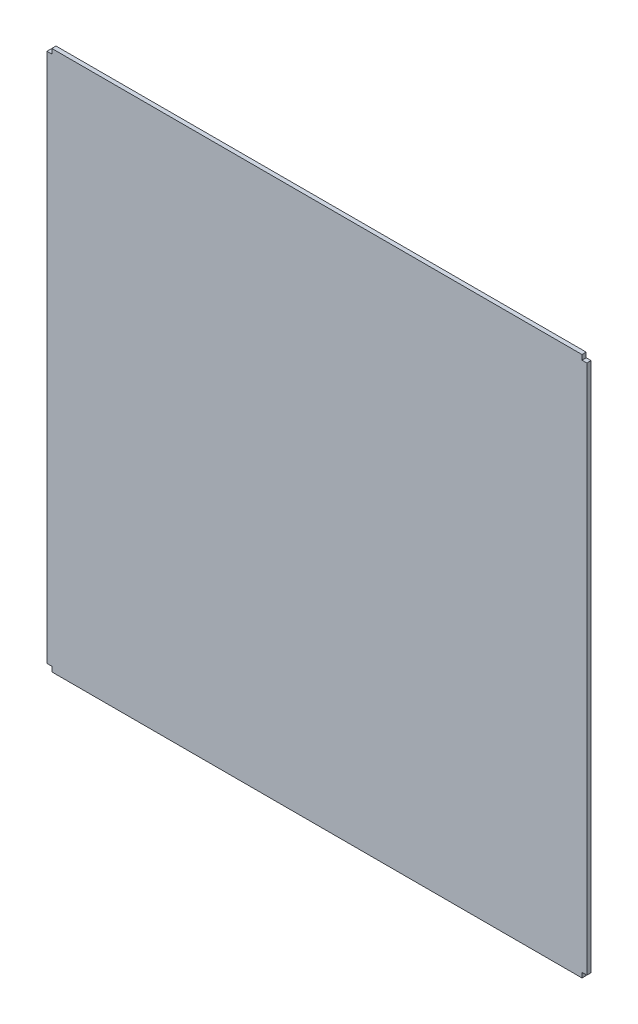
ISO-10303-21;
HEADER;
FILE_DESCRIPTION(('STEP AP214'),'2;1');
FILE_NAME('part.step','',(''),(''),'','','');
FILE_SCHEMA(('AUTOMOTIVE_DESIGN { 1 0 10303 214 1 1 1 1 }'));
ENDSEC;
DATA;
#1=APPLICATION_CONTEXT('core data for automotive mechanical design processes');
#2=APPLICATION_PROTOCOL_DEFINITION('international standard','automotive_design',2000,#1);
#3=PRODUCT_CONTEXT('',#1,'mechanical');
#4=PRODUCT('Part','Part','',(#3));
#5=PRODUCT_RELATED_PRODUCT_CATEGORY('part','',(#4));
#6=PRODUCT_DEFINITION_FORMATION('','',#4);
#7=PRODUCT_DEFINITION_CONTEXT('part definition',#1,'design');
#8=PRODUCT_DEFINITION('design','',#6,#7);
#9=PRODUCT_DEFINITION_SHAPE('','',#8);
#10=(LENGTH_UNIT() NAMED_UNIT(*) SI_UNIT(.MILLI.,.METRE.));
#11=(NAMED_UNIT(*) PLANE_ANGLE_UNIT() SI_UNIT($,.RADIAN.));
#12=(NAMED_UNIT(*) SI_UNIT($,.STERADIAN.) SOLID_ANGLE_UNIT());
#13=UNCERTAINTY_MEASURE_WITH_UNIT(LENGTH_MEASURE(1.E-05),#10,'distance_accuracy_value','');
#14=(GEOMETRIC_REPRESENTATION_CONTEXT(3) GLOBAL_UNCERTAINTY_ASSIGNED_CONTEXT((#13)) GLOBAL_UNIT_ASSIGNED_CONTEXT((#10,
#11,#12)) REPRESENTATION_CONTEXT('',''));
#15=CARTESIAN_POINT('',(0.,0.,0.));
#16=DIRECTION('',(0.,0.,1.));
#17=DIRECTION('',(1.,0.,0.));
#18=AXIS2_PLACEMENT_3D('',#15,#16,#17);
#19=CARTESIAN_POINT('',(289.5,-289.5,2.2479));
#20=DIRECTION('',(-1.,0.,0.));
#21=DIRECTION('',(0.,0.,1.));
#22=AXIS2_PLACEMENT_3D('',#19,#20,#21);
#23=PLANE('',#22);
#24=DIRECTION('',(0.,1.,0.));
#25=VECTOR('',#24,1.);
#26=CARTESIAN_POINT('',(289.5,-289.5,-2.2479));
#27=LINE('',#26,#25);
#28=CARTESIAN_POINT('',(289.5,-284.250006437494,-2.2479));
#29=VERTEX_POINT('',#28);
#30=CARTESIAN_POINT('',(289.5,284.249993562506,-2.2479));
#31=VERTEX_POINT('',#30);
#32=EDGE_CURVE('E145',#29,#31,#27,.T.);
#33=ORIENTED_EDGE('',*,*,#32,.T.);
#34=DIRECTION('',(0.,0.,1.));
#35=VECTOR('',#34,1.);
#36=CARTESIAN_POINT('',(289.5,284.249993562506,2.2479));
#37=LINE('',#36,#35);
#38=CARTESIAN_POINT('',(289.5,284.249993562506,2.2479));
#39=VERTEX_POINT('',#38);
#40=EDGE_CURVE('E47',#31,#39,#37,.T.);
#41=ORIENTED_EDGE('',*,*,#40,.T.);
#42=DIRECTION('',(0.,1.,0.));
#43=VECTOR('',#42,1.);
#44=CARTESIAN_POINT('',(289.5,-289.5,2.2479));
#45=LINE('',#44,#43);
#46=CARTESIAN_POINT('',(289.5,-284.250006437494,2.2479));
#47=VERTEX_POINT('',#46);
#48=EDGE_CURVE('E156',#47,#39,#45,.T.);
#49=ORIENTED_EDGE('',*,*,#48,.F.);
#50=DIRECTION('',(0.,0.,-1.));
#51=VECTOR('',#50,1.);
#52=CARTESIAN_POINT('',(289.5,-284.250006437494,2.2479));
#53=LINE('',#52,#51);
#54=EDGE_CURVE('E166',#47,#29,#53,.T.);
#55=ORIENTED_EDGE('',*,*,#54,.T.);
#56=EDGE_LOOP('',(#33,#41,#49,#55));
#57=FACE_BOUND('',#56,.T.);
#58=ADVANCED_FACE('F33',(#57),#23,.F.);
#59=CARTESIAN_POINT('',(-289.5,289.5,2.2479));
#60=DIRECTION('',(0.,-1.,0.));
#61=DIRECTION('',(0.,0.,-1.));
#62=AXIS2_PLACEMENT_3D('',#59,#60,#61);
#63=PLANE('',#62);
#64=DIRECTION('',(-1.,0.,0.));
#65=VECTOR('',#64,1.);
#66=CARTESIAN_POINT('',(-289.5,289.5,2.2479));
#67=LINE('',#66,#65);
#68=CARTESIAN_POINT('',(284.249999999999,289.5,2.2479));
#69=VERTEX_POINT('',#68);
#70=CARTESIAN_POINT('',(-284.249999999999,289.5,2.2479));
#71=VERTEX_POINT('',#70);
#72=EDGE_CURVE('E208',#69,#71,#67,.T.);
#73=ORIENTED_EDGE('',*,*,#72,.F.);
#74=DIRECTION('',(0.,0.,-1.));
#75=VECTOR('',#74,1.);
#76=CARTESIAN_POINT('',(284.249999999999,289.5,2.2479));
#77=LINE('',#76,#75);
#78=CARTESIAN_POINT('',(284.249999999999,289.5,-2.2479));
#79=VERTEX_POINT('',#78);
#80=EDGE_CURVE('E228',#69,#79,#77,.T.);
#81=ORIENTED_EDGE('',*,*,#80,.T.);
#82=DIRECTION('',(-1.,0.,0.));
#83=VECTOR('',#82,1.);
#84=CARTESIAN_POINT('',(-289.5,289.5,-2.2479));
#85=LINE('',#84,#83);
#86=CARTESIAN_POINT('',(-284.249999999999,289.5,-2.2479));
#87=VERTEX_POINT('',#86);
#88=EDGE_CURVE('E138',#79,#87,#85,.T.);
#89=ORIENTED_EDGE('',*,*,#88,.T.);
#90=DIRECTION('',(0.,0.,1.));
#91=VECTOR('',#90,1.);
#92=CARTESIAN_POINT('',(-284.249999999999,289.5,2.2479));
#93=LINE('',#92,#91);
#94=EDGE_CURVE('E201',#87,#71,#93,.T.);
#95=ORIENTED_EDGE('',*,*,#94,.T.);
#96=EDGE_LOOP('',(#73,#81,#89,#95));
#97=FACE_BOUND('',#96,.T.);
#98=ADVANCED_FACE('F244',(#97),#63,.F.);
#99=CARTESIAN_POINT('',(-289.5,-289.5,2.2479));
#100=DIRECTION('',(1.,0.,0.));
#101=DIRECTION('',(0.,0.,-1.));
#102=AXIS2_PLACEMENT_3D('',#99,#100,#101);
#103=PLANE('',#102);
#104=DIRECTION('',(0.,-1.,0.));
#105=VECTOR('',#104,1.);
#106=CARTESIAN_POINT('',(-289.5,-289.5,-2.2479));
#107=LINE('',#106,#105);
#108=CARTESIAN_POINT('',(-289.5,284.249993562506,-2.2479));
#109=VERTEX_POINT('',#108);
#110=CARTESIAN_POINT('',(-289.5,-284.250006437494,-2.2479));
#111=VERTEX_POINT('',#110);
#112=EDGE_CURVE('E144',#109,#111,#107,.T.);
#113=ORIENTED_EDGE('',*,*,#112,.T.);
#114=DIRECTION('',(0.,0.,1.));
#115=VECTOR('',#114,1.);
#116=CARTESIAN_POINT('',(-289.5,-284.250006437494,2.2479));
#117=LINE('',#116,#115);
#118=CARTESIAN_POINT('',(-289.5,-284.250006437494,2.2479));
#119=VERTEX_POINT('',#118);
#120=EDGE_CURVE('E186',#111,#119,#117,.T.);
#121=ORIENTED_EDGE('',*,*,#120,.T.);
#122=DIRECTION('',(0.,-1.,0.));
#123=VECTOR('',#122,1.);
#124=CARTESIAN_POINT('',(-289.5,-289.5,2.2479));
#125=LINE('',#124,#123);
#126=CARTESIAN_POINT('',(-289.5,284.249993562506,2.2479));
#127=VERTEX_POINT('',#126);
#128=EDGE_CURVE('E210',#127,#119,#125,.T.);
#129=ORIENTED_EDGE('',*,*,#128,.F.);
#130=DIRECTION('',(0.,0.,-1.));
#131=VECTOR('',#130,1.);
#132=CARTESIAN_POINT('',(-289.5,284.249993562506,2.2479));
#133=LINE('',#132,#131);
#134=EDGE_CURVE('E150',#127,#109,#133,.T.);
#135=ORIENTED_EDGE('',*,*,#134,.T.);
#136=EDGE_LOOP('',(#113,#121,#129,#135));
#137=FACE_BOUND('',#136,.T.);
#138=ADVANCED_FACE('F248',(#137),#103,.F.);
#139=CARTESIAN_POINT('',(-289.5,-289.5,2.2479));
#140=DIRECTION('',(0.,1.,0.));
#141=DIRECTION('',(0.,0.,1.));
#142=AXIS2_PLACEMENT_3D('',#139,#140,#141);
#143=PLANE('',#142);
#144=DIRECTION('',(1.,0.,0.));
#145=VECTOR('',#144,1.);
#146=CARTESIAN_POINT('',(-289.5,-289.5,-2.2479));
#147=LINE('',#146,#145);
#148=CARTESIAN_POINT('',(-284.249999999999,-289.5,-2.2479));
#149=VERTEX_POINT('',#148);
#150=CARTESIAN_POINT('',(284.25,-289.5,-2.2479));
#151=VERTEX_POINT('',#150);
#152=EDGE_CURVE('E148',#149,#151,#147,.T.);
#153=ORIENTED_EDGE('',*,*,#152,.T.);
#154=DIRECTION('',(0.,0.,1.));
#155=VECTOR('',#154,1.);
#156=CARTESIAN_POINT('',(284.25,-289.5,2.2479));
#157=LINE('',#156,#155);
#158=CARTESIAN_POINT('',(284.25,-289.5,2.2479));
#159=VERTEX_POINT('',#158);
#160=EDGE_CURVE('E55',#151,#159,#157,.T.);
#161=ORIENTED_EDGE('',*,*,#160,.T.);
#162=DIRECTION('',(1.,0.,0.));
#163=VECTOR('',#162,1.);
#164=CARTESIAN_POINT('',(-289.5,-289.5,2.2479));
#165=LINE('',#164,#163);
#166=CARTESIAN_POINT('',(-284.249999999999,-289.5,2.2479));
#167=VERTEX_POINT('',#166);
#168=EDGE_CURVE('E160',#167,#159,#165,.T.);
#169=ORIENTED_EDGE('',*,*,#168,.F.);
#170=DIRECTION('',(0.,0.,-1.));
#171=VECTOR('',#170,1.);
#172=CARTESIAN_POINT('',(-284.249999999999,-289.5,2.2479));
#173=LINE('',#172,#171);
#174=EDGE_CURVE('E191',#167,#149,#173,.T.);
#175=ORIENTED_EDGE('',*,*,#174,.T.);
#176=EDGE_LOOP('',(#153,#161,#169,#175));
#177=FACE_BOUND('',#176,.T.);
#178=ADVANCED_FACE('F221',(#177),#143,.F.);
#179=CARTESIAN_POINT('',(0.,0.,2.2479));
#180=DIRECTION('',(0.,0.,-1.));
#181=DIRECTION('',(-1.,0.,0.));
#182=AXIS2_PLACEMENT_3D('',#179,#180,#181);
#183=PLANE('',#182);
#184=DIRECTION('',(1.,0.,0.));
#185=VECTOR('',#184,1.);
#186=CARTESIAN_POINT('',(303.749999999999,284.249993562506,2.2479));
#187=LINE('',#186,#185);
#188=CARTESIAN_POINT('',(284.249999999999,284.249993562506,2.2479));
#189=VERTEX_POINT('',#188);
#190=EDGE_CURVE('E133',#189,#39,#187,.T.);
#191=ORIENTED_EDGE('',*,*,#190,.F.);
#192=DIRECTION('',(0.,-1.,0.));
#193=VECTOR('',#192,1.);
#194=CARTESIAN_POINT('',(284.249999999999,284.249993562506,2.2479));
#195=LINE('',#194,#193);
#196=EDGE_CURVE('E132',#69,#189,#195,.T.);
#197=ORIENTED_EDGE('',*,*,#196,.F.);
#198=ORIENTED_EDGE('',*,*,#72,.T.);
#199=DIRECTION('',(0.,1.,0.));
#200=VECTOR('',#199,1.);
#201=CARTESIAN_POINT('',(-284.249999999999,303.749993562506,2.2479));
#202=LINE('',#201,#200);
#203=CARTESIAN_POINT('',(-284.249999999999,284.249993562506,2.2479));
#204=VERTEX_POINT('',#203);
#205=EDGE_CURVE('E195',#204,#71,#202,.T.);
#206=ORIENTED_EDGE('',*,*,#205,.F.);
#207=DIRECTION('',(1.,0.,0.));
#208=VECTOR('',#207,1.);
#209=CARTESIAN_POINT('',(-284.249999999999,284.249993562506,2.2479));
#210=LINE('',#209,#208);
#211=EDGE_CURVE('E194',#127,#204,#210,.T.);
#212=ORIENTED_EDGE('',*,*,#211,.F.);
#213=ORIENTED_EDGE('',*,*,#128,.T.);
#214=DIRECTION('',(-1.,0.,0.));
#215=VECTOR('',#214,1.);
#216=CARTESIAN_POINT('',(-303.749999999999,-284.250006437494,2.2479));
#217=LINE('',#216,#215);
#218=CARTESIAN_POINT('',(-284.249999999999,-284.250006437494,2.2479));
#219=VERTEX_POINT('',#218);
#220=EDGE_CURVE('E175',#219,#119,#217,.T.);
#221=ORIENTED_EDGE('',*,*,#220,.F.);
#222=DIRECTION('',(0.,1.,0.));
#223=VECTOR('',#222,1.);
#224=CARTESIAN_POINT('',(-284.249999999999,-284.250006437494,2.2479));
#225=LINE('',#224,#223);
#226=EDGE_CURVE('E173',#167,#219,#225,.T.);
#227=ORIENTED_EDGE('',*,*,#226,.F.);
#228=ORIENTED_EDGE('',*,*,#168,.T.);
#229=DIRECTION('',(0.,-1.,0.));
#230=VECTOR('',#229,1.);
#231=CARTESIAN_POINT('',(284.25,-303.750006437494,2.2479));
#232=LINE('',#231,#230);
#233=CARTESIAN_POINT('',(284.25,-284.250006437494,2.2479));
#234=VERTEX_POINT('',#233);
#235=EDGE_CURVE('E218',#234,#159,#232,.T.);
#236=ORIENTED_EDGE('',*,*,#235,.F.);
#237=DIRECTION('',(-1.,0.,0.));
#238=VECTOR('',#237,1.);
#239=CARTESIAN_POINT('',(284.25,-284.250006437494,2.2479));
#240=LINE('',#239,#238);
#241=EDGE_CURVE('E226',#47,#234,#240,.T.);
#242=ORIENTED_EDGE('',*,*,#241,.F.);
#243=ORIENTED_EDGE('',*,*,#48,.T.);
#244=EDGE_LOOP('',(#191,#197,#198,#206,#212,#213,#221,#227,#228,#236,#242,#243));
#245=FACE_BOUND('',#244,.T.);
#246=ADVANCED_FACE('F217',(#245),#183,.F.);
#247=CARTESIAN_POINT('',(0.,0.,-2.2479));
#248=DIRECTION('',(0.,0.,-1.));
#249=DIRECTION('',(-1.,0.,0.));
#250=AXIS2_PLACEMENT_3D('',#247,#248,#249);
#251=PLANE('',#250);
#252=DIRECTION('',(0.,1.,0.));
#253=VECTOR('',#252,1.);
#254=CARTESIAN_POINT('',(284.249999999999,0.,-2.2479));
#255=LINE('',#254,#253);
#256=CARTESIAN_POINT('',(284.249999999999,284.249993562506,-2.2479));
#257=VERTEX_POINT('',#256);
#258=EDGE_CURVE('E11',#257,#79,#255,.T.);
#259=ORIENTED_EDGE('',*,*,#258,.F.);
#260=DIRECTION('',(1.,0.,0.));
#261=VECTOR('',#260,1.);
#262=CARTESIAN_POINT('',(303.749999999999,284.249993562506,-2.2479));
#263=LINE('',#262,#261);
#264=EDGE_CURVE('E118',#257,#31,#263,.T.);
#265=ORIENTED_EDGE('',*,*,#264,.T.);
#266=ORIENTED_EDGE('',*,*,#32,.F.);
#267=DIRECTION('',(1.,0.,0.));
#268=VECTOR('',#267,1.);
#269=CARTESIAN_POINT('',(0.,-284.250006437494,-2.2479));
#270=LINE('',#269,#268);
#271=CARTESIAN_POINT('',(284.25,-284.250006437494,-2.2479));
#272=VERTEX_POINT('',#271);
#273=EDGE_CURVE('E40',#272,#29,#270,.T.);
#274=ORIENTED_EDGE('',*,*,#273,.F.);
#275=DIRECTION('',(0.,-1.,0.));
#276=VECTOR('',#275,1.);
#277=CARTESIAN_POINT('',(284.25,-303.750006437494,-2.2479));
#278=LINE('',#277,#276);
#279=EDGE_CURVE('E177',#272,#151,#278,.T.);
#280=ORIENTED_EDGE('',*,*,#279,.T.);
#281=ORIENTED_EDGE('',*,*,#152,.F.);
#282=DIRECTION('',(0.,-1.,0.));
#283=VECTOR('',#282,1.);
#284=CARTESIAN_POINT('',(-284.249999999999,0.,-2.2479));
#285=LINE('',#284,#283);
#286=CARTESIAN_POINT('',(-284.249999999999,-284.250006437494,-2.2479));
#287=VERTEX_POINT('',#286);
#288=EDGE_CURVE('E159',#287,#149,#285,.T.);
#289=ORIENTED_EDGE('',*,*,#288,.F.);
#290=DIRECTION('',(-1.,0.,0.));
#291=VECTOR('',#290,1.);
#292=CARTESIAN_POINT('',(-303.749999999999,-284.250006437494,-2.2479));
#293=LINE('',#292,#291);
#294=EDGE_CURVE('E183',#287,#111,#293,.T.);
#295=ORIENTED_EDGE('',*,*,#294,.T.);
#296=ORIENTED_EDGE('',*,*,#112,.F.);
#297=DIRECTION('',(-1.,0.,0.));
#298=VECTOR('',#297,1.);
#299=CARTESIAN_POINT('',(0.,284.249993562506,-2.2479));
#300=LINE('',#299,#298);
#301=CARTESIAN_POINT('',(-284.249999999999,284.249993562506,-2.2479));
#302=VERTEX_POINT('',#301);
#303=EDGE_CURVE('E157',#302,#109,#300,.T.);
#304=ORIENTED_EDGE('',*,*,#303,.F.);
#305=DIRECTION('',(0.,1.,0.));
#306=VECTOR('',#305,1.);
#307=CARTESIAN_POINT('',(-284.249999999999,303.749993562506,-2.2479));
#308=LINE('',#307,#306);
#309=EDGE_CURVE('E140',#302,#87,#308,.T.);
#310=ORIENTED_EDGE('',*,*,#309,.T.);
#311=ORIENTED_EDGE('',*,*,#88,.F.);
#312=EDGE_LOOP('',(#259,#265,#266,#274,#280,#281,#289,#295,#296,#304,#310,#311));
#313=FACE_BOUND('',#312,.T.);
#314=ADVANCED_FACE('F136',(#313),#251,.T.);
#315=CARTESIAN_POINT('',(-284.249999999999,284.249993562506,-29.8250644662754));
#316=DIRECTION('',(0.,-1.,0.));
#317=DIRECTION('',(0.,0.,-1.));
#318=AXIS2_PLACEMENT_3D('',#315,#316,#317);
#319=PLANE('',#318);
#320=ORIENTED_EDGE('',*,*,#211,.T.);
#321=DIRECTION('',(0.,0.,1.));
#322=VECTOR('',#321,1.);
#323=CARTESIAN_POINT('',(-284.249999999999,284.249993562506,-29.8250644662754));
#324=LINE('',#323,#322);
#325=EDGE_CURVE('E198',#302,#204,#324,.T.);
#326=ORIENTED_EDGE('',*,*,#325,.F.);
#327=ORIENTED_EDGE('',*,*,#303,.T.);
#328=ORIENTED_EDGE('',*,*,#134,.F.);
#329=EDGE_LOOP('',(#320,#326,#327,#328));
#330=FACE_BOUND('',#329,.T.);
#331=ADVANCED_FACE('F260',(#330),#319,.F.);
#332=CARTESIAN_POINT('',(-284.249999999999,303.749993562506,-29.8250644662754));
#333=DIRECTION('',(1.,0.,0.));
#334=DIRECTION('',(0.,0.,-1.));
#335=AXIS2_PLACEMENT_3D('',#332,#333,#334);
#336=PLANE('',#335);
#337=ORIENTED_EDGE('',*,*,#309,.F.);
#338=ORIENTED_EDGE('',*,*,#325,.T.);
#339=ORIENTED_EDGE('',*,*,#205,.T.);
#340=ORIENTED_EDGE('',*,*,#94,.F.);
#341=EDGE_LOOP('',(#337,#338,#339,#340));
#342=FACE_BOUND('',#341,.T.);
#343=ADVANCED_FACE('F265',(#342),#336,.F.);
#344=CARTESIAN_POINT('',(-284.249999999999,-284.250006437494,-29.8250644662754));
#345=DIRECTION('',(1.,0.,0.));
#346=DIRECTION('',(0.,0.,-1.));
#347=AXIS2_PLACEMENT_3D('',#344,#345,#346);
#348=PLANE('',#347);
#349=ORIENTED_EDGE('',*,*,#226,.T.);
#350=DIRECTION('',(0.,0.,1.));
#351=VECTOR('',#350,1.);
#352=CARTESIAN_POINT('',(-284.249999999999,-284.250006437494,-29.8250644662754));
#353=LINE('',#352,#351);
#354=EDGE_CURVE('E181',#287,#219,#353,.T.);
#355=ORIENTED_EDGE('',*,*,#354,.F.);
#356=ORIENTED_EDGE('',*,*,#288,.T.);
#357=ORIENTED_EDGE('',*,*,#174,.F.);
#358=EDGE_LOOP('',(#349,#355,#356,#357));
#359=FACE_BOUND('',#358,.T.);
#360=ADVANCED_FACE('F269',(#359),#348,.F.);
#361=CARTESIAN_POINT('',(-303.749999999999,-284.250006437494,-29.8250644662754));
#362=DIRECTION('',(0.,1.,0.));
#363=DIRECTION('',(0.,0.,1.));
#364=AXIS2_PLACEMENT_3D('',#361,#362,#363);
#365=PLANE('',#364);
#366=ORIENTED_EDGE('',*,*,#294,.F.);
#367=ORIENTED_EDGE('',*,*,#354,.T.);
#368=ORIENTED_EDGE('',*,*,#220,.T.);
#369=ORIENTED_EDGE('',*,*,#120,.F.);
#370=EDGE_LOOP('',(#366,#367,#368,#369));
#371=FACE_BOUND('',#370,.T.);
#372=ADVANCED_FACE('F241',(#371),#365,.F.);
#373=CARTESIAN_POINT('',(284.25,-284.250006437494,-29.8250644662754));
#374=DIRECTION('',(0.,1.,0.));
#375=DIRECTION('',(0.,0.,1.));
#376=AXIS2_PLACEMENT_3D('',#373,#374,#375);
#377=PLANE('',#376);
#378=ORIENTED_EDGE('',*,*,#241,.T.);
#379=DIRECTION('',(0.,0.,1.));
#380=VECTOR('',#379,1.);
#381=CARTESIAN_POINT('',(284.25,-284.250006437494,-29.8250644662754));
#382=LINE('',#381,#380);
#383=EDGE_CURVE('E169',#272,#234,#382,.T.);
#384=ORIENTED_EDGE('',*,*,#383,.F.);
#385=ORIENTED_EDGE('',*,*,#273,.T.);
#386=ORIENTED_EDGE('',*,*,#54,.F.);
#387=EDGE_LOOP('',(#378,#384,#385,#386));
#388=FACE_BOUND('',#387,.T.);
#389=ADVANCED_FACE('F165',(#388),#377,.F.);
#390=CARTESIAN_POINT('',(284.25,-303.750006437494,-29.8250644662754));
#391=DIRECTION('',(-1.,0.,0.));
#392=DIRECTION('',(0.,0.,1.));
#393=AXIS2_PLACEMENT_3D('',#390,#391,#392);
#394=PLANE('',#393);
#395=ORIENTED_EDGE('',*,*,#279,.F.);
#396=ORIENTED_EDGE('',*,*,#383,.T.);
#397=ORIENTED_EDGE('',*,*,#235,.T.);
#398=ORIENTED_EDGE('',*,*,#160,.F.);
#399=EDGE_LOOP('',(#395,#396,#397,#398));
#400=FACE_BOUND('',#399,.T.);
#401=ADVANCED_FACE('F233',(#400),#394,.F.);
#402=CARTESIAN_POINT('',(284.249999999999,284.249993562506,-29.8250644662754));
#403=DIRECTION('',(-1.,0.,0.));
#404=DIRECTION('',(0.,0.,1.));
#405=AXIS2_PLACEMENT_3D('',#402,#403,#404);
#406=PLANE('',#405);
#407=ORIENTED_EDGE('',*,*,#196,.T.);
#408=DIRECTION('',(0.,0.,1.));
#409=VECTOR('',#408,1.);
#410=CARTESIAN_POINT('',(284.249999999999,284.249993562506,-29.8250644662754));
#411=LINE('',#410,#409);
#412=EDGE_CURVE('E121',#257,#189,#411,.T.);
#413=ORIENTED_EDGE('',*,*,#412,.F.);
#414=ORIENTED_EDGE('',*,*,#258,.T.);
#415=ORIENTED_EDGE('',*,*,#80,.F.);
#416=EDGE_LOOP('',(#407,#413,#414,#415));
#417=FACE_BOUND('',#416,.T.);
#418=ADVANCED_FACE('F129',(#417),#406,.F.);
#419=CARTESIAN_POINT('',(303.749999999999,284.249993562506,-29.8250644662754));
#420=DIRECTION('',(0.,-1.,0.));
#421=DIRECTION('',(0.,0.,-1.));
#422=AXIS2_PLACEMENT_3D('',#419,#420,#421);
#423=PLANE('',#422);
#424=ORIENTED_EDGE('',*,*,#264,.F.);
#425=ORIENTED_EDGE('',*,*,#412,.T.);
#426=ORIENTED_EDGE('',*,*,#190,.T.);
#427=ORIENTED_EDGE('',*,*,#40,.F.);
#428=EDGE_LOOP('',(#424,#425,#426,#427));
#429=FACE_BOUND('',#428,.T.);
#430=ADVANCED_FACE('F120',(#429),#423,.F.);
#431=CLOSED_SHELL('',(#58,#98,#138,#178,#246,#314,#331,#343,#360,#372,#389,#401,#418,#430));
#432=MANIFOLD_SOLID_BREP('B2',#431);
#433=ADVANCED_BREP_SHAPE_REPRESENTATION('',(#18,#432),#14);
#434=SHAPE_DEFINITION_REPRESENTATION(#9,#433);
ENDSEC;
END-ISO-10303-21;
